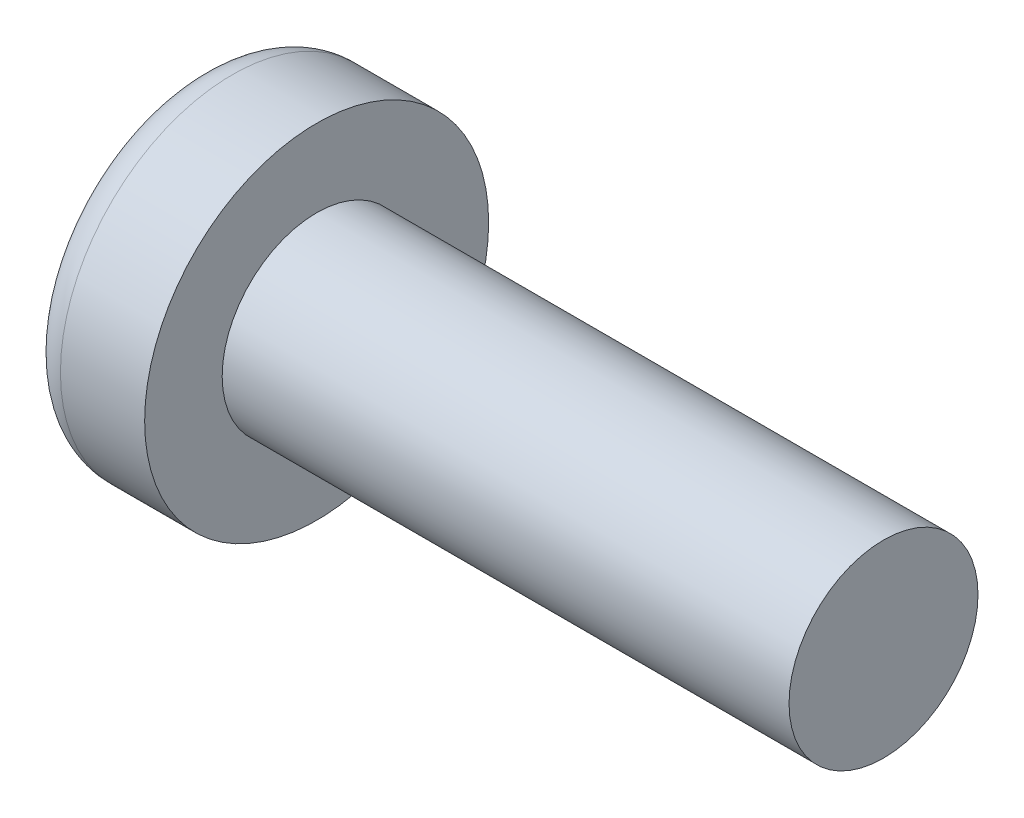
ISO-10303-21;
HEADER;
FILE_DESCRIPTION(('STEP AP214'),'2;1');
FILE_NAME('part.step','',(''),(''),'','','');
FILE_SCHEMA(('AUTOMOTIVE_DESIGN { 1 0 10303 214 1 1 1 1 }'));
ENDSEC;
DATA;
#1=APPLICATION_CONTEXT('core data for automotive mechanical design processes');
#2=APPLICATION_PROTOCOL_DEFINITION('international standard','automotive_design',2000,#1);
#3=PRODUCT_CONTEXT('',#1,'mechanical');
#4=PRODUCT('Part','Part','',(#3));
#5=PRODUCT_RELATED_PRODUCT_CATEGORY('part','',(#4));
#6=PRODUCT_DEFINITION_FORMATION('','',#4);
#7=PRODUCT_DEFINITION_CONTEXT('part definition',#1,'design');
#8=PRODUCT_DEFINITION('design','',#6,#7);
#9=PRODUCT_DEFINITION_SHAPE('','',#8);
#10=(LENGTH_UNIT() NAMED_UNIT(*) SI_UNIT(.MILLI.,.METRE.));
#11=(NAMED_UNIT(*) PLANE_ANGLE_UNIT() SI_UNIT($,.RADIAN.));
#12=(NAMED_UNIT(*) SI_UNIT($,.STERADIAN.) SOLID_ANGLE_UNIT());
#13=UNCERTAINTY_MEASURE_WITH_UNIT(LENGTH_MEASURE(1.E-05),#10,'distance_accuracy_value','');
#14=(GEOMETRIC_REPRESENTATION_CONTEXT(3) GLOBAL_UNCERTAINTY_ASSIGNED_CONTEXT((#13)) GLOBAL_UNIT_ASSIGNED_CONTEXT((#10,
#11,#12)) REPRESENTATION_CONTEXT('',''));
#15=CARTESIAN_POINT('',(0.,0.,0.));
#16=DIRECTION('',(0.,0.,1.));
#17=DIRECTION('',(1.,0.,0.));
#18=AXIS2_PLACEMENT_3D('',#15,#16,#17);
#19=CARTESIAN_POINT('',(5.,0.,0.));
#20=DIRECTION('',(-1.,0.,0.));
#21=DIRECTION('',(0.,1.,0.));
#22=AXIS2_PLACEMENT_3D('',#19,#20,#21);
#23=SPHERICAL_SURFACE('',#22,5.);
#24=CARTESIAN_POINT('',(0.23816923010293,0.,0.));
#25=DIRECTION('',(-1.,0.,0.));
#26=DIRECTION('',(0.,0.,1.));
#27=AXIS2_PLACEMENT_3D('',#24,#25,#26);
#28=CIRCLE('',#27,1.52478448275862);
#29=CARTESIAN_POINT('',(0.23816923010293,0.,1.52478448275862));
#30=VERTEX_POINT('',#29);
#31=EDGE_CURVE('E153',#30,#30,#28,.T.);
#32=ORIENTED_EDGE('',*,*,#31,.T.);
#33=EDGE_LOOP('',(#32));
#34=FACE_BOUND('',#33,.T.);
#35=CARTESIAN_POINT('',(4.98382636322272,-0.153868112043298,0.));
#36=DIRECTION('',(-0.104537710696287,-0.994520923380891,0.));
#37=DIRECTION('',(0.994520923380891,-0.104537710696287,0.));
#38=AXIS2_PLACEMENT_3D('',#35,#36,#37);
#39=CIRCLE('',#38,4.99760572850337);
#40=CARTESIAN_POINT('',(0.188596138461545,0.350175974082163,1.31444652548077));
#41=VERTEX_POINT('',#40);
#42=CARTESIAN_POINT('',(0.0270341343313616,0.367158343834486,0.367158343834487));
#43=VERTEX_POINT('',#42);
#44=EDGE_CURVE('E184',#41,#43,#39,.T.);
#45=ORIENTED_EDGE('',*,*,#44,.F.);
#46=CARTESIAN_POINT('',(3.98403090792016,0.,-1.41352221506761));
#47=DIRECTION('',(0.583636048152575,0.,0.812015371342713));
#48=DIRECTION('',(0.812015371342714,0.,-0.583636048152575));
#49=AXIS2_PLACEMENT_3D('',#46,#47,#48);
#50=CIRCLE('',#49,4.68719124331927);
#51=CARTESIAN_POINT('',(0.188596138461544,-0.350175974082172,1.31444652548076));
#52=VERTEX_POINT('',#51);
#53=EDGE_CURVE('E149',#41,#52,#50,.T.);
#54=ORIENTED_EDGE('',*,*,#53,.T.);
#55=CARTESIAN_POINT('',(4.98382636322272,0.153868112043297,0.));
#56=DIRECTION('',(-0.104537710696287,0.994520923380891,0.));
#57=DIRECTION('',(-0.994520923380891,-0.104537710696287,0.));
#58=AXIS2_PLACEMENT_3D('',#55,#56,#57);
#59=CIRCLE('',#58,4.99760572850337);
#60=CARTESIAN_POINT('',(0.0270341343313607,-0.367158343834489,0.367158343834487));
#61=VERTEX_POINT('',#60);
#62=EDGE_CURVE('E105',#61,#52,#59,.T.);
#63=ORIENTED_EDGE('',*,*,#62,.F.);
#64=CARTESIAN_POINT('',(4.98382636322272,0.,-0.153868112043297));
#65=DIRECTION('',(-0.104537710696287,0.,-0.994520923380891));
#66=DIRECTION('',(-0.994520923380891,0.,0.104537710696287));
#67=AXIS2_PLACEMENT_3D('',#64,#65,#66);
#68=CIRCLE('',#67,4.99760572850337);
#69=CARTESIAN_POINT('',(0.188596138461544,-1.31444652548077,0.350175974082167));
#70=VERTEX_POINT('',#69);
#71=EDGE_CURVE('E130',#70,#61,#68,.T.);
#72=ORIENTED_EDGE('',*,*,#71,.F.);
#73=CARTESIAN_POINT('',(3.98403090792016,1.41352221506761,0.));
#74=DIRECTION('',(0.583636048152575,-0.812015371342713,0.));
#75=DIRECTION('',(0.812015371342714,0.583636048152575,0.));
#76=AXIS2_PLACEMENT_3D('',#73,#74,#75);
#77=CIRCLE('',#76,4.68719124331927);
#78=CARTESIAN_POINT('',(0.188596138461544,-1.31444652548077,-0.350175974082167));
#79=VERTEX_POINT('',#78);
#80=EDGE_CURVE('E138',#70,#79,#77,.T.);
#81=ORIENTED_EDGE('',*,*,#80,.T.);
#82=CARTESIAN_POINT('',(4.98382636322272,0.,0.153868112043297));
#83=DIRECTION('',(-0.104537710696287,0.,0.994520923380891));
#84=DIRECTION('',(0.994520923380891,0.,0.104537710696287));
#85=AXIS2_PLACEMENT_3D('',#82,#83,#84);
#86=CIRCLE('',#85,4.99760572850337);
#87=CARTESIAN_POINT('',(0.0270341343313616,-0.367158343834486,-0.367158343834487));
#88=VERTEX_POINT('',#87);
#89=EDGE_CURVE('E48',#88,#79,#86,.T.);
#90=ORIENTED_EDGE('',*,*,#89,.F.);
#91=CARTESIAN_POINT('',(0.188596138461545,-0.350175974082162,-1.31444652548077));
#92=VERTEX_POINT('',#91);
#93=EDGE_CURVE('E191',#92,#88,#59,.T.);
#94=ORIENTED_EDGE('',*,*,#93,.F.);
#95=CARTESIAN_POINT('',(3.98403090792016,0.,1.41352221506761));
#96=DIRECTION('',(0.583636048152575,0.,-0.812015371342713));
#97=DIRECTION('',(-0.812015371342714,0.,-0.583636048152575));
#98=AXIS2_PLACEMENT_3D('',#95,#96,#97);
#99=CIRCLE('',#98,4.68719124331927);
#100=CARTESIAN_POINT('',(0.188596138461544,0.350175974082172,-1.31444652548076));
#101=VERTEX_POINT('',#100);
#102=EDGE_CURVE('E131',#92,#101,#99,.T.);
#103=ORIENTED_EDGE('',*,*,#102,.T.);
#104=CARTESIAN_POINT('',(0.0270341343313616,0.367158343834489,-0.367158343834487));
#105=VERTEX_POINT('',#104);
#106=EDGE_CURVE('E179',#105,#101,#39,.T.);
#107=ORIENTED_EDGE('',*,*,#106,.F.);
#108=CARTESIAN_POINT('',(0.188596138461545,1.31444652548076,-0.350175974082167));
#109=VERTEX_POINT('',#108);
#110=EDGE_CURVE('E41',#109,#105,#86,.T.);
#111=ORIENTED_EDGE('',*,*,#110,.F.);
#112=CARTESIAN_POINT('',(3.98403090792016,-1.41352221506761,0.));
#113=DIRECTION('',(0.583636048152575,0.812015371342713,0.));
#114=DIRECTION('',(-0.812015371342714,0.583636048152575,0.));
#115=AXIS2_PLACEMENT_3D('',#112,#113,#114);
#116=CIRCLE('',#115,4.68719124331927);
#117=CARTESIAN_POINT('',(0.188596138461545,1.31444652548076,0.350175974082167));
#118=VERTEX_POINT('',#117);
#119=EDGE_CURVE('E11',#109,#118,#116,.T.);
#120=ORIENTED_EDGE('',*,*,#119,.T.);
#121=EDGE_CURVE('E167',#43,#118,#68,.T.);
#122=ORIENTED_EDGE('',*,*,#121,.F.);
#123=EDGE_LOOP('',(#45,#54,#63,#72,#81,#90,#94,#103,#107,#111,#120,#122));
#124=FACE_BOUND('',#123,.T.);
#125=ADVANCED_FACE('F33',(#34,#124),#23,.T.);
#126=CARTESIAN_POINT('',(2.01739130434783,0.,-0.15794466403162));
#127=DIRECTION('',(-0.104537710696287,0.,0.994520923380891));
#128=DIRECTION('',(0.994520923380891,0.,0.104537710696287));
#129=AXIS2_PLACEMENT_3D('',#126,#127,#128);
#130=PLANE('',#129);
#131=ORIENTED_EDGE('',*,*,#110,.T.);
#132=DIRECTION('',(0.989130931836555,-0.103971149085093,0.103971149085092));
#133=VECTOR('',#132,1.);
#134=CARTESIAN_POINT('',(2.03363450411053,0.156237282238383,-0.156237282238382));
#135=LINE('',#134,#133);
#136=CARTESIAN_POINT('',(1.76,0.185000000000001,-0.184999999999999));
#137=VERTEX_POINT('',#136);
#138=EDGE_CURVE('E173',#105,#137,#135,.T.);
#139=ORIENTED_EDGE('',*,*,#138,.T.);
#140=DIRECTION('',(0.80907355338853,-0.581521616498006,0.0850446632823171));
#141=VECTOR('',#140,1.);
#142=CARTESIAN_POINT('',(0.,1.45,-0.37));
#143=LINE('',#142,#141);
#144=EDGE_CURVE('E154',#109,#137,#143,.T.);
#145=ORIENTED_EDGE('',*,*,#144,.F.);
#146=EDGE_LOOP('',(#131,#139,#145));
#147=FACE_BOUND('',#146,.T.);
#148=ADVANCED_FACE('F172',(#147),#130,.T.);
#149=DIRECTION('',(0.80907355338853,0.581521616498006,0.0850446632823171));
#150=VECTOR('',#149,1.);
#151=CARTESIAN_POINT('',(0.,-1.45,-0.37));
#152=LINE('',#151,#150);
#153=CARTESIAN_POINT('',(1.76,-0.185,-0.185));
#154=VERTEX_POINT('',#153);
#155=EDGE_CURVE('E139',#79,#154,#152,.T.);
#156=ORIENTED_EDGE('',*,*,#155,.T.);
#157=DIRECTION('',(-0.989130931836555,-0.103971149085092,-0.103971149085092));
#158=VECTOR('',#157,1.);
#159=CARTESIAN_POINT('',(2.03363450411053,-0.156237282238382,-0.156237282238382));
#160=LINE('',#159,#158);
#161=EDGE_CURVE('E194',#154,#88,#160,.T.);
#162=ORIENTED_EDGE('',*,*,#161,.T.);
#163=ORIENTED_EDGE('',*,*,#89,.T.);
#164=EDGE_LOOP('',(#156,#162,#163));
#165=FACE_BOUND('',#164,.T.);
#166=ADVANCED_FACE('F209',(#165),#130,.T.);
#167=CARTESIAN_POINT('',(2.01739130434783,0.,0.157944664031621));
#168=DIRECTION('',(-0.104537710696287,0.,-0.994520923380891));
#169=DIRECTION('',(-0.994520923380891,0.,0.104537710696287));
#170=AXIS2_PLACEMENT_3D('',#167,#168,#169);
#171=PLANE('',#170);
#172=DIRECTION('',(0.80907355338853,-0.581521616498006,-0.085044663282317));
#173=VECTOR('',#172,1.);
#174=CARTESIAN_POINT('',(0.,1.45,0.37));
#175=LINE('',#174,#173);
#176=CARTESIAN_POINT('',(1.76,0.185,0.185));
#177=VERTEX_POINT('',#176);
#178=EDGE_CURVE('E210',#118,#177,#175,.T.);
#179=ORIENTED_EDGE('',*,*,#178,.T.);
#180=DIRECTION('',(-0.989130931836555,0.103971149085092,0.103971149085092));
#181=VECTOR('',#180,1.);
#182=CARTESIAN_POINT('',(2.03363450411053,0.156237282238382,0.156237282238382));
#183=LINE('',#182,#181);
#184=EDGE_CURVE('E188',#177,#43,#183,.T.);
#185=ORIENTED_EDGE('',*,*,#184,.T.);
#186=ORIENTED_EDGE('',*,*,#121,.T.);
#187=EDGE_LOOP('',(#179,#185,#186));
#188=FACE_BOUND('',#187,.T.);
#189=ADVANCED_FACE('F214',(#188),#171,.T.);
#190=ORIENTED_EDGE('',*,*,#71,.T.);
#191=DIRECTION('',(0.989130931836555,0.103971149085093,-0.103971149085092));
#192=VECTOR('',#191,1.);
#193=CARTESIAN_POINT('',(2.03363450411053,-0.156237282238383,0.156237282238382));
#194=LINE('',#193,#192);
#195=CARTESIAN_POINT('',(1.76,-0.185000000000001,0.184999999999999));
#196=VERTEX_POINT('',#195);
#197=EDGE_CURVE('E103',#61,#196,#194,.T.);
#198=ORIENTED_EDGE('',*,*,#197,.T.);
#199=DIRECTION('',(0.80907355338853,0.581521616498006,-0.0850446632823168));
#200=VECTOR('',#199,1.);
#201=CARTESIAN_POINT('',(0.,-1.45,0.369999999999999));
#202=LINE('',#201,#200);
#203=EDGE_CURVE('E128',#70,#196,#202,.T.);
#204=ORIENTED_EDGE('',*,*,#203,.F.);
#205=EDGE_LOOP('',(#190,#198,#204));
#206=FACE_BOUND('',#205,.T.);
#207=ADVANCED_FACE('F127',(#206),#171,.T.);
#208=CARTESIAN_POINT('',(-25.4,0.,0.));
#209=DIRECTION('',(-1.,0.,0.));
#210=DIRECTION('',(0.,0.,1.));
#211=AXIS2_PLACEMENT_3D('',#208,#209,#210);
#212=CYLINDRICAL_SURFACE('',#211,0.975);
#213=CARTESIAN_POINT('',(7.3,0.,0.));
#214=DIRECTION('',(-1.,0.,0.));
#215=DIRECTION('',(0.,0.,1.));
#216=AXIS2_PLACEMENT_3D('',#213,#214,#215);
#217=CIRCLE('',#216,0.975);
#218=CARTESIAN_POINT('',(7.3,0.,0.975));
#219=VERTEX_POINT('',#218);
#220=EDGE_CURVE('E150',#219,#219,#217,.T.);
#221=ORIENTED_EDGE('',*,*,#220,.T.);
#222=EDGE_LOOP('',(#221));
#223=FACE_BOUND('',#222,.T.);
#224=CARTESIAN_POINT('',(1.45,0.,0.));
#225=DIRECTION('',(-1.,0.,0.));
#226=DIRECTION('',(0.,0.,1.));
#227=AXIS2_PLACEMENT_3D('',#224,#225,#226);
#228=CIRCLE('',#227,0.975);
#229=CARTESIAN_POINT('',(1.45,0.,0.975));
#230=VERTEX_POINT('',#229);
#231=EDGE_CURVE('E163',#230,#230,#228,.T.);
#232=ORIENTED_EDGE('',*,*,#231,.F.);
#233=EDGE_LOOP('',(#232));
#234=FACE_BOUND('',#233,.T.);
#235=ADVANCED_FACE('F35',(#223,#234),#212,.T.);
#236=CARTESIAN_POINT('',(1.45,0.975,0.));
#237=DIRECTION('',(-1.,0.,0.));
#238=DIRECTION('',(0.,0.,1.));
#239=AXIS2_PLACEMENT_3D('',#236,#237,#238);
#240=PLANE('',#239);
#241=CARTESIAN_POINT('',(1.45,0.,0.));
#242=DIRECTION('',(-1.,0.,0.));
#243=DIRECTION('',(0.,0.,1.));
#244=AXIS2_PLACEMENT_3D('',#241,#242,#243);
#245=CIRCLE('',#244,1.775);
#246=CARTESIAN_POINT('',(1.45,0.,1.775));
#247=VERTEX_POINT('',#246);
#248=EDGE_CURVE('E160',#247,#247,#245,.T.);
#249=ORIENTED_EDGE('',*,*,#248,.F.);
#250=EDGE_LOOP('',(#249));
#251=FACE_BOUND('',#250,.T.);
#252=ORIENTED_EDGE('',*,*,#231,.T.);
#253=EDGE_LOOP('',(#252));
#254=FACE_BOUND('',#253,.T.);
#255=ADVANCED_FACE('F242',(#251,#254),#240,.F.);
#256=CARTESIAN_POINT('',(-25.4,0.,0.));
#257=DIRECTION('',(-1.,0.,0.));
#258=DIRECTION('',(0.,0.,1.));
#259=AXIS2_PLACEMENT_3D('',#256,#257,#258);
#260=CYLINDRICAL_SURFACE('',#259,1.775);
#261=ORIENTED_EDGE('',*,*,#248,.T.);
#262=EDGE_LOOP('',(#261));
#263=FACE_BOUND('',#262,.T.);
#264=CARTESIAN_POINT('',(0.581021045535521,0.,0.));
#265=DIRECTION('',(-1.,0.,0.));
#266=DIRECTION('',(0.,0.,1.));
#267=AXIS2_PLACEMENT_3D('',#264,#265,#266);
#268=CIRCLE('',#267,1.775);
#269=CARTESIAN_POINT('',(0.581021045535521,0.,1.775));
#270=VERTEX_POINT('',#269);
#271=EDGE_CURVE('E157',#270,#270,#268,.T.);
#272=ORIENTED_EDGE('',*,*,#271,.F.);
#273=EDGE_LOOP('',(#272));
#274=FACE_BOUND('',#273,.T.);
#275=ADVANCED_FACE('F239',(#263,#274),#260,.T.);
#276=CARTESIAN_POINT('',(0.581021045535519,0.,0.));
#277=DIRECTION('',(-1.,0.,0.));
#278=DIRECTION('',(0.,0.,1.));
#279=AXIS2_PLACEMENT_3D('',#276,#277,#278);
#280=TOROIDAL_SURFACE('',#279,1.415,0.360000000000001);
#281=ORIENTED_EDGE('',*,*,#271,.T.);
#282=EDGE_LOOP('',(#281));
#283=FACE_BOUND('',#282,.T.);
#284=ORIENTED_EDGE('',*,*,#31,.F.);
#285=EDGE_LOOP('',(#284));
#286=FACE_BOUND('',#285,.T.);
#287=ADVANCED_FACE('F236',(#283,#286),#280,.T.);
#288=CARTESIAN_POINT('',(7.3,0.975,0.));
#289=DIRECTION('',(1.,0.,0.));
#290=DIRECTION('',(0.,0.,-1.));
#291=AXIS2_PLACEMENT_3D('',#288,#289,#290);
#292=PLANE('',#291);
#293=ORIENTED_EDGE('',*,*,#220,.F.);
#294=EDGE_LOOP('',(#293));
#295=FACE_BOUND('',#294,.T.);
#296=ADVANCED_FACE('F234',(#295),#292,.T.);
#297=CARTESIAN_POINT('',(1.76,0.185,0.185));
#298=DIRECTION('',(0.583636048152575,0.812015371342713,0.));
#299=DIRECTION('',(-0.812015371342714,0.583636048152575,0.));
#300=AXIS2_PLACEMENT_3D('',#297,#298,#299);
#301=PLANE('',#300);
#302=ORIENTED_EDGE('',*,*,#144,.T.);
#303=DIRECTION('',(0.,0.,-1.));
#304=VECTOR('',#303,1.);
#305=CARTESIAN_POINT('',(1.76,0.185,0.185));
#306=LINE('',#305,#304);
#307=EDGE_CURVE('E121',#177,#137,#306,.T.);
#308=ORIENTED_EDGE('',*,*,#307,.F.);
#309=ORIENTED_EDGE('',*,*,#178,.F.);
#310=ORIENTED_EDGE('',*,*,#119,.F.);
#311=EDGE_LOOP('',(#302,#308,#309,#310));
#312=FACE_BOUND('',#311,.T.);
#313=ADVANCED_FACE('F213',(#312),#301,.F.);
#314=CARTESIAN_POINT('',(1.76,-0.185,-0.185));
#315=DIRECTION('',(0.583636048152575,-0.812015371342713,0.));
#316=DIRECTION('',(0.812015371342714,0.583636048152575,0.));
#317=AXIS2_PLACEMENT_3D('',#314,#315,#316);
#318=PLANE('',#317);
#319=ORIENTED_EDGE('',*,*,#203,.T.);
#320=DIRECTION('',(0.,0.,1.));
#321=VECTOR('',#320,1.);
#322=CARTESIAN_POINT('',(1.76,-0.185,-0.185));
#323=LINE('',#322,#321);
#324=EDGE_CURVE('E120',#154,#196,#323,.T.);
#325=ORIENTED_EDGE('',*,*,#324,.F.);
#326=ORIENTED_EDGE('',*,*,#155,.F.);
#327=ORIENTED_EDGE('',*,*,#80,.F.);
#328=EDGE_LOOP('',(#319,#325,#326,#327));
#329=FACE_BOUND('',#328,.T.);
#330=ADVANCED_FACE('F135',(#329),#318,.F.);
#331=CARTESIAN_POINT('',(1.76,0.185,-0.185));
#332=DIRECTION('',(-1.,0.,0.));
#333=DIRECTION('',(0.,0.,1.));
#334=AXIS2_PLACEMENT_3D('',#331,#332,#333);
#335=PLANE('',#334);
#336=DIRECTION('',(0.,1.,0.));
#337=VECTOR('',#336,1.);
#338=CARTESIAN_POINT('',(1.76,-0.185,-0.185));
#339=LINE('',#338,#337);
#340=EDGE_CURVE('E143',#154,#137,#339,.T.);
#341=ORIENTED_EDGE('',*,*,#340,.F.);
#342=ORIENTED_EDGE('',*,*,#324,.T.);
#343=DIRECTION('',(0.,-1.,0.));
#344=VECTOR('',#343,1.);
#345=CARTESIAN_POINT('',(1.76,0.185,0.185));
#346=LINE('',#345,#344);
#347=EDGE_CURVE('E112',#177,#196,#346,.T.);
#348=ORIENTED_EDGE('',*,*,#347,.F.);
#349=ORIENTED_EDGE('',*,*,#307,.T.);
#350=EDGE_LOOP('',(#341,#342,#348,#349));
#351=FACE_BOUND('',#350,.T.);
#352=ADVANCED_FACE('F141',(#351),#335,.T.);
#353=CARTESIAN_POINT('',(1.76,0.185000000000001,-0.184999999999999));
#354=DIRECTION('',(0.583636048152575,0.,-0.812015371342713));
#355=DIRECTION('',(0.812015371342714,0.,0.583636048152575));
#356=AXIS2_PLACEMENT_3D('',#353,#354,#355);
#357=PLANE('',#356);
#358=DIRECTION('',(0.80907355338853,0.0850446632823148,0.581521616498006));
#359=VECTOR('',#358,1.);
#360=CARTESIAN_POINT('',(0.,-0.369999999999994,-1.45));
#361=LINE('',#360,#359);
#362=EDGE_CURVE('E199',#92,#154,#361,.T.);
#363=ORIENTED_EDGE('',*,*,#362,.T.);
#364=ORIENTED_EDGE('',*,*,#340,.T.);
#365=DIRECTION('',(0.80907355338853,-0.0850446632823191,0.581521616498006));
#366=VECTOR('',#365,1.);
#367=CARTESIAN_POINT('',(0.,0.370000000000005,-1.45));
#368=LINE('',#367,#366);
#369=EDGE_CURVE('E109',#101,#137,#368,.T.);
#370=ORIENTED_EDGE('',*,*,#369,.F.);
#371=ORIENTED_EDGE('',*,*,#102,.F.);
#372=EDGE_LOOP('',(#363,#364,#370,#371));
#373=FACE_BOUND('',#372,.T.);
#374=ADVANCED_FACE('F204',(#373),#357,.F.);
#375=CARTESIAN_POINT('',(2.01739130434783,-0.157944664031621,0.));
#376=DIRECTION('',(-0.104537710696287,0.994520923380891,0.));
#377=DIRECTION('',(-0.994520923380891,-0.104537710696287,0.));
#378=AXIS2_PLACEMENT_3D('',#375,#376,#377);
#379=PLANE('',#378);
#380=ORIENTED_EDGE('',*,*,#93,.T.);
#381=ORIENTED_EDGE('',*,*,#161,.F.);
#382=ORIENTED_EDGE('',*,*,#362,.F.);
#383=EDGE_LOOP('',(#380,#381,#382));
#384=FACE_BOUND('',#383,.T.);
#385=ADVANCED_FACE('F208',(#384),#379,.T.);
#386=CARTESIAN_POINT('',(2.01739130434783,0.15794466403162,0.));
#387=DIRECTION('',(-0.104537710696287,-0.994520923380891,0.));
#388=DIRECTION('',(0.994520923380891,-0.104537710696287,0.));
#389=AXIS2_PLACEMENT_3D('',#386,#387,#388);
#390=PLANE('',#389);
#391=ORIENTED_EDGE('',*,*,#106,.T.);
#392=ORIENTED_EDGE('',*,*,#369,.T.);
#393=ORIENTED_EDGE('',*,*,#138,.F.);
#394=EDGE_LOOP('',(#391,#392,#393));
#395=FACE_BOUND('',#394,.T.);
#396=ADVANCED_FACE('F202',(#395),#390,.T.);
#397=CARTESIAN_POINT('',(1.76,-0.185000000000001,0.184999999999999));
#398=DIRECTION('',(0.583636048152575,0.,0.812015371342713));
#399=DIRECTION('',(-0.812015371342714,0.,0.583636048152575));
#400=AXIS2_PLACEMENT_3D('',#397,#398,#399);
#401=PLANE('',#400);
#402=DIRECTION('',(0.80907355338853,-0.0850446632823151,-0.581521616498006));
#403=VECTOR('',#402,1.);
#404=CARTESIAN_POINT('',(0.,0.369999999999995,1.45));
#405=LINE('',#404,#403);
#406=EDGE_CURVE('E108',#41,#177,#405,.T.);
#407=ORIENTED_EDGE('',*,*,#406,.T.);
#408=ORIENTED_EDGE('',*,*,#347,.T.);
#409=DIRECTION('',(0.80907355338853,0.085044663282319,-0.581521616498006));
#410=VECTOR('',#409,1.);
#411=CARTESIAN_POINT('',(0.,-0.370000000000005,1.45));
#412=LINE('',#411,#410);
#413=EDGE_CURVE('E99',#52,#196,#412,.T.);
#414=ORIENTED_EDGE('',*,*,#413,.F.);
#415=ORIENTED_EDGE('',*,*,#53,.F.);
#416=EDGE_LOOP('',(#407,#408,#414,#415));
#417=FACE_BOUND('',#416,.T.);
#418=ADVANCED_FACE('F113',(#417),#401,.F.);
#419=ORIENTED_EDGE('',*,*,#44,.T.);
#420=ORIENTED_EDGE('',*,*,#184,.F.);
#421=ORIENTED_EDGE('',*,*,#406,.F.);
#422=EDGE_LOOP('',(#419,#420,#421));
#423=FACE_BOUND('',#422,.T.);
#424=ADVANCED_FACE('F215',(#423),#390,.T.);
#425=ORIENTED_EDGE('',*,*,#62,.T.);
#426=ORIENTED_EDGE('',*,*,#413,.T.);
#427=ORIENTED_EDGE('',*,*,#197,.F.);
#428=EDGE_LOOP('',(#425,#426,#427));
#429=FACE_BOUND('',#428,.T.);
#430=ADVANCED_FACE('F101',(#429),#379,.T.);
#431=CLOSED_SHELL('',(#125,#148,#166,#189,#207,#235,#255,#275,#287,#296,#313,#330,#352,#374,
#385,#396,#418,#424,#430));
#432=MANIFOLD_SOLID_BREP('B2',#431);
#433=ADVANCED_BREP_SHAPE_REPRESENTATION('',(#18,#432),#14);
#434=SHAPE_DEFINITION_REPRESENTATION(#9,#433);
ENDSEC;
END-ISO-10303-21;
